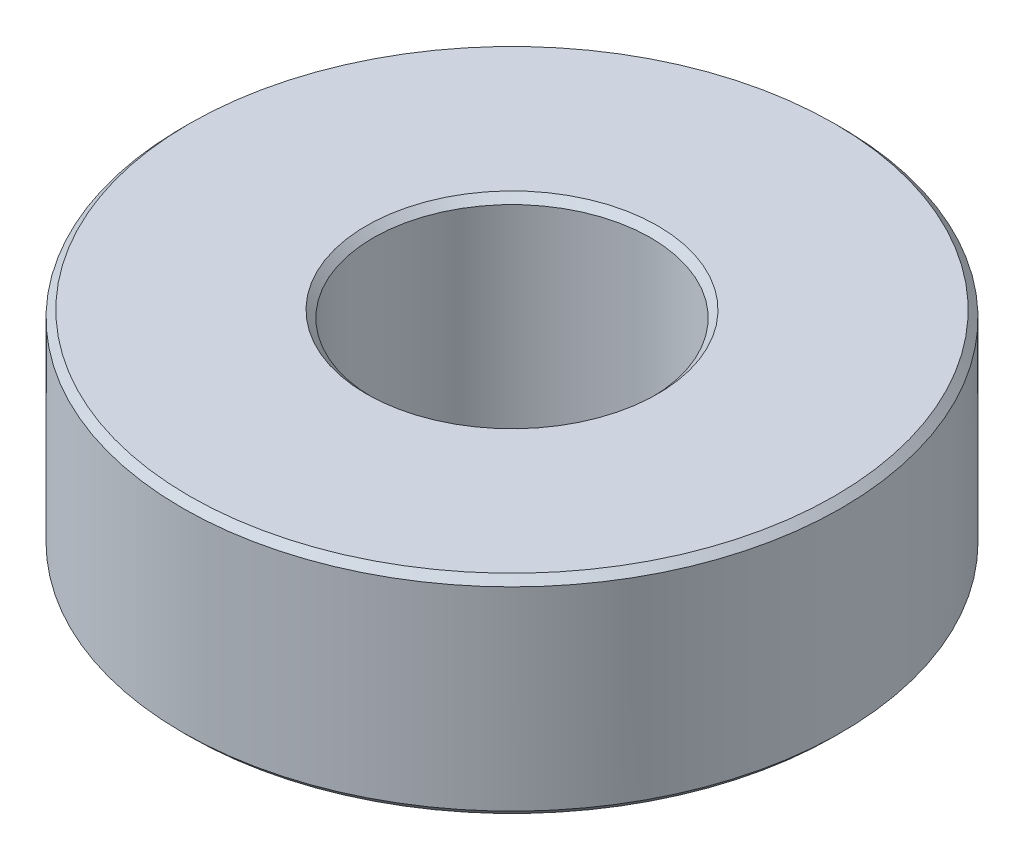
ISO-10303-21;
HEADER;
FILE_DESCRIPTION(('STEP AP214'),'2;1');
FILE_NAME('part.step','',(''),(''),'','','');
FILE_SCHEMA(('AUTOMOTIVE_DESIGN { 1 0 10303 214 1 1 1 1 }'));
ENDSEC;
DATA;
#1=APPLICATION_CONTEXT('core data for automotive mechanical design processes');
#2=APPLICATION_PROTOCOL_DEFINITION('international standard','automotive_design',2000,#1);
#3=PRODUCT_CONTEXT('',#1,'mechanical');
#4=PRODUCT('Part','Part','',(#3));
#5=PRODUCT_RELATED_PRODUCT_CATEGORY('part','',(#4));
#6=PRODUCT_DEFINITION_FORMATION('','',#4);
#7=PRODUCT_DEFINITION_CONTEXT('part definition',#1,'design');
#8=PRODUCT_DEFINITION('design','',#6,#7);
#9=PRODUCT_DEFINITION_SHAPE('','',#8);
#10=(LENGTH_UNIT() NAMED_UNIT(*) SI_UNIT(.MILLI.,.METRE.));
#11=(NAMED_UNIT(*) PLANE_ANGLE_UNIT() SI_UNIT($,.RADIAN.));
#12=(NAMED_UNIT(*) SI_UNIT($,.STERADIAN.) SOLID_ANGLE_UNIT());
#13=UNCERTAINTY_MEASURE_WITH_UNIT(LENGTH_MEASURE(1.E-05),#10,'distance_accuracy_value','');
#14=(GEOMETRIC_REPRESENTATION_CONTEXT(3) GLOBAL_UNCERTAINTY_ASSIGNED_CONTEXT((#13)) GLOBAL_UNIT_ASSIGNED_CONTEXT((#10,
#11,#12)) REPRESENTATION_CONTEXT('',''));
#15=CARTESIAN_POINT('',(0.,0.,0.));
#16=DIRECTION('',(0.,0.,1.));
#17=DIRECTION('',(1.,0.,0.));
#18=AXIS2_PLACEMENT_3D('',#15,#16,#17);
#19=CARTESIAN_POINT('',(0.,6.,0.));
#20=DIRECTION('',(0.,1.,0.));
#21=DIRECTION('',(0.,0.,1.));
#22=AXIS2_PLACEMENT_3D('',#19,#20,#21);
#23=CYLINDRICAL_SURFACE('',#22,4.);
#24=CARTESIAN_POINT('',(0.,0.199999999949796,0.));
#25=DIRECTION('',(0.,-1.,0.));
#26=DIRECTION('',(0.,0.,-1.));
#27=AXIS2_PLACEMENT_3D('',#24,#25,#26);
#28=CIRCLE('',#27,4.0000000000191);
#29=CARTESIAN_POINT('',(0.,0.199999999949796,-4.0000000000191));
#30=VERTEX_POINT('',#29);
#31=EDGE_CURVE('E34',#30,#30,#28,.T.);
#32=ORIENTED_EDGE('',*,*,#31,.T.);
#33=EDGE_LOOP('',(#32));
#34=FACE_BOUND('',#33,.T.);
#35=CARTESIAN_POINT('',(0.,5.79999999996517,0.));
#36=DIRECTION('',(0.,1.,0.));
#37=DIRECTION('',(0.,0.,1.));
#38=AXIS2_PLACEMENT_3D('',#35,#36,#37);
#39=CIRCLE('',#38,4.00000000007594);
#40=CARTESIAN_POINT('',(0.,5.79999999996517,4.00000000007594));
#41=VERTEX_POINT('',#40);
#42=EDGE_CURVE('E37',#41,#41,#39,.T.);
#43=ORIENTED_EDGE('',*,*,#42,.T.);
#44=EDGE_LOOP('',(#43));
#45=FACE_BOUND('',#44,.T.);
#46=ADVANCED_FACE('F15',(#34,#45),#23,.F.);
#47=CARTESIAN_POINT('',(0.,5.99999999985812,0.));
#48=DIRECTION('',(0.,1.,0.));
#49=DIRECTION('',(0.,0.,1.));
#50=AXIS2_PLACEMENT_3D('',#47,#48,#49);
#51=CONICAL_SURFACE('',#50,4.1999999999689,0.785398163397448);
#52=CARTESIAN_POINT('',(0.,5.99999999991496,0.));
#53=DIRECTION('',(0.,1.,0.));
#54=DIRECTION('',(0.,0.,1.));
#55=AXIS2_PLACEMENT_3D('',#52,#53,#54);
#56=CIRCLE('',#55,4.20000000002574);
#57=CARTESIAN_POINT('',(0.,5.99999999991496,4.20000000002574));
#58=VERTEX_POINT('',#57);
#59=EDGE_CURVE('E18',#58,#58,#56,.F.);
#60=ORIENTED_EDGE('',*,*,#59,.F.);
#61=EDGE_LOOP('',(#60));
#62=FACE_BOUND('',#61,.T.);
#63=ORIENTED_EDGE('',*,*,#42,.F.);
#64=EDGE_LOOP('',(#63));
#65=FACE_BOUND('',#64,.T.);
#66=ADVANCED_FACE('F58',(#62,#65),#51,.F.);
#67=CARTESIAN_POINT('',(0.,0.,0.));
#68=DIRECTION('',(0.,-1.,0.));
#69=DIRECTION('',(0.,0.,-1.));
#70=AXIS2_PLACEMENT_3D('',#67,#68,#69);
#71=CONICAL_SURFACE('',#70,4.1999999999689,0.785398163397448);
#72=ORIENTED_EDGE('',*,*,#31,.F.);
#73=EDGE_LOOP('',(#72));
#74=FACE_BOUND('',#73,.T.);
#75=CARTESIAN_POINT('',(0.,0.,0.));
#76=DIRECTION('',(0.,-1.,0.));
#77=DIRECTION('',(0.,0.,-1.));
#78=AXIS2_PLACEMENT_3D('',#75,#76,#77);
#79=CIRCLE('',#78,4.1999999999689);
#80=CARTESIAN_POINT('',(0.,0.,-4.1999999999689));
#81=VERTEX_POINT('',#80);
#82=EDGE_CURVE('E48',#81,#81,#79,.T.);
#83=ORIENTED_EDGE('',*,*,#82,.T.);
#84=EDGE_LOOP('',(#83));
#85=FACE_BOUND('',#84,.T.);
#86=ADVANCED_FACE('F61',(#74,#85),#71,.F.);
#87=CARTESIAN_POINT('',(0.,6.,0.));
#88=DIRECTION('',(0.,1.,0.));
#89=DIRECTION('',(0.,0.,1.));
#90=AXIS2_PLACEMENT_3D('',#87,#88,#89);
#91=PLANE('',#90);
#92=ORIENTED_EDGE('',*,*,#59,.T.);
#93=EDGE_LOOP('',(#92));
#94=FACE_BOUND('',#93,.T.);
#95=CARTESIAN_POINT('',(0.,6.,0.));
#96=DIRECTION('',(0.,-1.,0.));
#97=DIRECTION('',(1.,0.,0.));
#98=AXIS2_PLACEMENT_3D('',#95,#96,#97);
#99=CIRCLE('',#98,9.3);
#100=CARTESIAN_POINT('',(9.3,6.,0.));
#101=VERTEX_POINT('',#100);
#102=EDGE_CURVE('E46',#101,#101,#99,.T.);
#103=ORIENTED_EDGE('',*,*,#102,.F.);
#104=EDGE_LOOP('',(#103));
#105=FACE_BOUND('',#104,.T.);
#106=ADVANCED_FACE('F55',(#94,#105),#91,.T.);
#107=CARTESIAN_POINT('',(0.,0.,0.));
#108=DIRECTION('',(0.,1.,0.));
#109=DIRECTION('',(0.,0.,1.));
#110=AXIS2_PLACEMENT_3D('',#107,#108,#109);
#111=PLANE('',#110);
#112=ORIENTED_EDGE('',*,*,#82,.F.);
#113=EDGE_LOOP('',(#112));
#114=FACE_BOUND('',#113,.T.);
#115=CARTESIAN_POINT('',(0.,0.,0.));
#116=DIRECTION('',(0.,1.,0.));
#117=DIRECTION('',(-1.,0.,0.));
#118=AXIS2_PLACEMENT_3D('',#115,#116,#117);
#119=CIRCLE('',#118,9.3);
#120=CARTESIAN_POINT('',(-9.3,0.,0.));
#121=VERTEX_POINT('',#120);
#122=EDGE_CURVE('E27',#121,#121,#119,.T.);
#123=ORIENTED_EDGE('',*,*,#122,.F.);
#124=EDGE_LOOP('',(#123));
#125=FACE_BOUND('',#124,.T.);
#126=ADVANCED_FACE('F83',(#114,#125),#111,.F.);
#127=CARTESIAN_POINT('',(0.,5.8,0.));
#128=DIRECTION('',(0.,-1.,0.));
#129=DIRECTION('',(1.,0.,0.));
#130=AXIS2_PLACEMENT_3D('',#127,#128,#129);
#131=CONICAL_SURFACE('',#130,9.5,0.78539816339745);
#132=ORIENTED_EDGE('',*,*,#102,.T.);
#133=EDGE_LOOP('',(#132));
#134=FACE_BOUND('',#133,.T.);
#135=CARTESIAN_POINT('',(0.,5.8,0.));
#136=DIRECTION('',(0.,1.,0.));
#137=DIRECTION('',(0.,0.,1.));
#138=AXIS2_PLACEMENT_3D('',#135,#136,#137);
#139=CIRCLE('',#138,9.5);
#140=CARTESIAN_POINT('',(0.,5.8,9.5));
#141=VERTEX_POINT('',#140);
#142=EDGE_CURVE('E22',#141,#141,#139,.F.);
#143=ORIENTED_EDGE('',*,*,#142,.F.);
#144=EDGE_LOOP('',(#143));
#145=FACE_BOUND('',#144,.T.);
#146=ADVANCED_FACE('F76',(#134,#145),#131,.T.);
#147=CARTESIAN_POINT('',(0.,0.2,0.));
#148=DIRECTION('',(0.,1.,0.));
#149=DIRECTION('',(-1.,0.,0.));
#150=AXIS2_PLACEMENT_3D('',#147,#148,#149);
#151=CONICAL_SURFACE('',#150,9.5,0.785398163397452);
#152=CARTESIAN_POINT('',(0.,0.2,0.));
#153=DIRECTION('',(0.,1.,0.));
#154=DIRECTION('',(0.,0.,1.));
#155=AXIS2_PLACEMENT_3D('',#152,#153,#154);
#156=CIRCLE('',#155,9.5);
#157=CARTESIAN_POINT('',(0.,0.2,9.5));
#158=VERTEX_POINT('',#157);
#159=EDGE_CURVE('E10',#158,#158,#156,.T.);
#160=ORIENTED_EDGE('',*,*,#159,.F.);
#161=EDGE_LOOP('',(#160));
#162=FACE_BOUND('',#161,.T.);
#163=ORIENTED_EDGE('',*,*,#122,.T.);
#164=EDGE_LOOP('',(#163));
#165=FACE_BOUND('',#164,.T.);
#166=ADVANCED_FACE('F71',(#162,#165),#151,.T.);
#167=CARTESIAN_POINT('',(0.,6.,0.));
#168=DIRECTION('',(0.,1.,0.));
#169=DIRECTION('',(0.,0.,1.));
#170=AXIS2_PLACEMENT_3D('',#167,#168,#169);
#171=CYLINDRICAL_SURFACE('',#170,9.5);
#172=ORIENTED_EDGE('',*,*,#159,.T.);
#173=EDGE_LOOP('',(#172));
#174=FACE_BOUND('',#173,.T.);
#175=ORIENTED_EDGE('',*,*,#142,.T.);
#176=EDGE_LOOP('',(#175));
#177=FACE_BOUND('',#176,.T.);
#178=ADVANCED_FACE('F69',(#174,#177),#171,.T.);
#179=CLOSED_SHELL('',(#46,#66,#86,#106,#126,#146,#166,#178));
#180=MANIFOLD_SOLID_BREP('B1',#179);
#181=ADVANCED_BREP_SHAPE_REPRESENTATION('',(#18,#180),#14);
#182=SHAPE_DEFINITION_REPRESENTATION(#9,#181);
ENDSEC;
END-ISO-10303-21;
